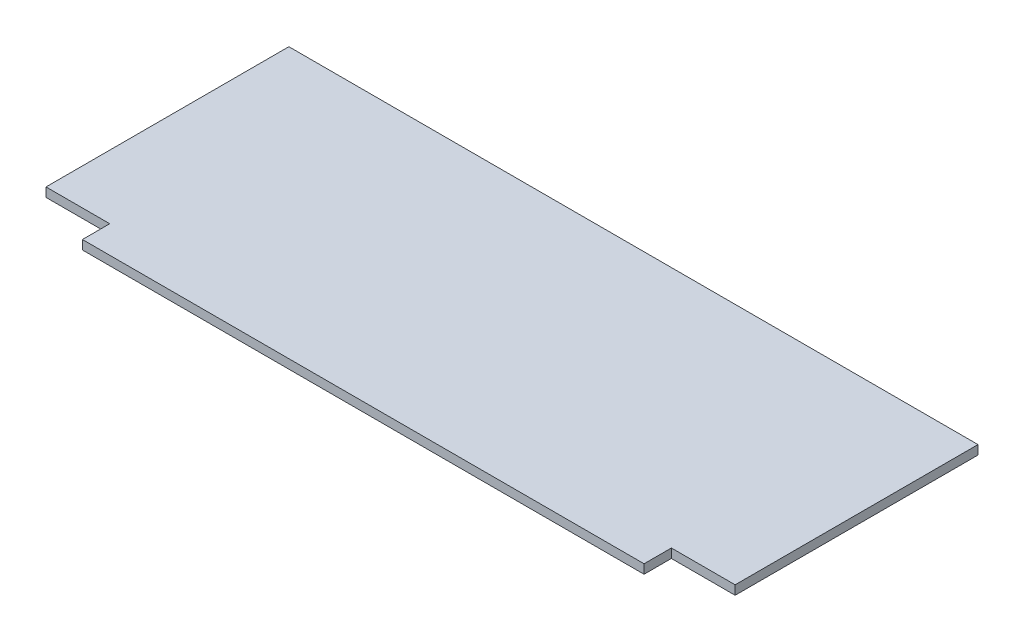
ISO-10303-21;
HEADER;
FILE_DESCRIPTION(('STEP AP214'),'2;1');
FILE_NAME('part.step','',(''),(''),'','','');
FILE_SCHEMA(('AUTOMOTIVE_DESIGN { 1 0 10303 214 1 1 1 1 }'));
ENDSEC;
DATA;
#1=APPLICATION_CONTEXT('core data for automotive mechanical design processes');
#2=APPLICATION_PROTOCOL_DEFINITION('international standard','automotive_design',2000,#1);
#3=PRODUCT_CONTEXT('',#1,'mechanical');
#4=PRODUCT('Part','Part','',(#3));
#5=PRODUCT_RELATED_PRODUCT_CATEGORY('part','',(#4));
#6=PRODUCT_DEFINITION_FORMATION('','',#4);
#7=PRODUCT_DEFINITION_CONTEXT('part definition',#1,'design');
#8=PRODUCT_DEFINITION('design','',#6,#7);
#9=PRODUCT_DEFINITION_SHAPE('','',#8);
#10=(LENGTH_UNIT() NAMED_UNIT(*) SI_UNIT(.MILLI.,.METRE.));
#11=(NAMED_UNIT(*) PLANE_ANGLE_UNIT() SI_UNIT($,.RADIAN.));
#12=(NAMED_UNIT(*) SI_UNIT($,.STERADIAN.) SOLID_ANGLE_UNIT());
#13=UNCERTAINTY_MEASURE_WITH_UNIT(LENGTH_MEASURE(1.E-05),#10,'distance_accuracy_value','');
#14=(GEOMETRIC_REPRESENTATION_CONTEXT(3) GLOBAL_UNCERTAINTY_ASSIGNED_CONTEXT((#13)) GLOBAL_UNIT_ASSIGNED_CONTEXT((#10,
#11,#12)) REPRESENTATION_CONTEXT('',''));
#15=CARTESIAN_POINT('',(0.,0.,0.));
#16=DIRECTION('',(0.,0.,1.));
#17=DIRECTION('',(1.,0.,0.));
#18=AXIS2_PLACEMENT_3D('',#15,#16,#17);
#19=CARTESIAN_POINT('',(0.,3.,44.5));
#20=DIRECTION('',(0.,0.,-1.));
#21=DIRECTION('',(-1.,0.,0.));
#22=AXIS2_PLACEMENT_3D('',#19,#20,#21);
#23=PLANE('',#22);
#24=DIRECTION('',(1.,0.,0.));
#25=VECTOR('',#24,1.);
#26=CARTESIAN_POINT('',(0.,0.,44.5));
#27=LINE('',#26,#25);
#28=CARTESIAN_POINT('',(-92.5,0.,44.5));
#29=VERTEX_POINT('',#28);
#30=CARTESIAN_POINT('',(92.5,0.,44.5));
#31=VERTEX_POINT('',#30);
#32=EDGE_CURVE('E148',#29,#31,#27,.T.);
#33=ORIENTED_EDGE('',*,*,#32,.T.);
#34=DIRECTION('',(0.,-1.,0.));
#35=VECTOR('',#34,1.);
#36=CARTESIAN_POINT('',(92.5,3.,44.5));
#37=LINE('',#36,#35);
#38=CARTESIAN_POINT('',(92.5,3.,44.5));
#39=VERTEX_POINT('',#38);
#40=EDGE_CURVE('E11',#39,#31,#37,.T.);
#41=ORIENTED_EDGE('',*,*,#40,.F.);
#42=DIRECTION('',(1.,0.,0.));
#43=VECTOR('',#42,1.);
#44=CARTESIAN_POINT('',(0.,3.,44.5));
#45=LINE('',#44,#43);
#46=CARTESIAN_POINT('',(-92.5,3.,44.5));
#47=VERTEX_POINT('',#46);
#48=EDGE_CURVE('E176',#47,#39,#45,.T.);
#49=ORIENTED_EDGE('',*,*,#48,.F.);
#50=DIRECTION('',(0.,-1.,0.));
#51=VECTOR('',#50,1.);
#52=CARTESIAN_POINT('',(-92.5,3.,44.5));
#53=LINE('',#52,#51);
#54=EDGE_CURVE('E61',#47,#29,#53,.T.);
#55=ORIENTED_EDGE('',*,*,#54,.T.);
#56=EDGE_LOOP('',(#33,#41,#49,#55));
#57=FACE_BOUND('',#56,.T.);
#58=ADVANCED_FACE('F44',(#57),#23,.F.);
#59=CARTESIAN_POINT('',(92.5,3.,0.));
#60=DIRECTION('',(-1.,0.,0.));
#61=DIRECTION('',(0.,0.,1.));
#62=AXIS2_PLACEMENT_3D('',#59,#60,#61);
#63=PLANE('',#62);
#64=DIRECTION('',(0.,0.,-1.));
#65=VECTOR('',#64,1.);
#66=CARTESIAN_POINT('',(92.5,0.,0.));
#67=LINE('',#66,#65);
#68=CARTESIAN_POINT('',(92.5,0.,35.5));
#69=VERTEX_POINT('',#68);
#70=EDGE_CURVE('E151',#31,#69,#67,.T.);
#71=ORIENTED_EDGE('',*,*,#70,.T.);
#72=DIRECTION('',(0.,-1.,0.));
#73=VECTOR('',#72,1.);
#74=CARTESIAN_POINT('',(92.5,3.,35.5));
#75=LINE('',#74,#73);
#76=CARTESIAN_POINT('',(92.5,3.,35.5));
#77=VERTEX_POINT('',#76);
#78=EDGE_CURVE('E53',#77,#69,#75,.T.);
#79=ORIENTED_EDGE('',*,*,#78,.F.);
#80=DIRECTION('',(0.,0.,-1.));
#81=VECTOR('',#80,1.);
#82=CARTESIAN_POINT('',(92.5,3.,0.));
#83=LINE('',#82,#81);
#84=EDGE_CURVE('E100',#39,#77,#83,.T.);
#85=ORIENTED_EDGE('',*,*,#84,.F.);
#86=ORIENTED_EDGE('',*,*,#40,.T.);
#87=EDGE_LOOP('',(#71,#79,#85,#86));
#88=FACE_BOUND('',#87,.T.);
#89=ADVANCED_FACE('F195',(#88),#63,.F.);
#90=CARTESIAN_POINT('',(0.,3.,35.5));
#91=DIRECTION('',(0.,0.,1.));
#92=DIRECTION('',(1.,0.,0.));
#93=AXIS2_PLACEMENT_3D('',#90,#91,#92);
#94=PLANE('',#93);
#95=DIRECTION('',(-1.,0.,0.));
#96=VECTOR('',#95,1.);
#97=CARTESIAN_POINT('',(0.,0.,35.5));
#98=LINE('',#97,#96);
#99=CARTESIAN_POINT('',(113.5,0.,35.5));
#100=VERTEX_POINT('',#99);
#101=EDGE_CURVE('E155',#100,#69,#98,.T.);
#102=ORIENTED_EDGE('',*,*,#101,.F.);
#103=DIRECTION('',(0.,-1.,0.));
#104=VECTOR('',#103,1.);
#105=CARTESIAN_POINT('',(113.5,3.,35.5));
#106=LINE('',#105,#104);
#107=CARTESIAN_POINT('',(113.5,3.,35.5));
#108=VERTEX_POINT('',#107);
#109=EDGE_CURVE('E186',#108,#100,#106,.T.);
#110=ORIENTED_EDGE('',*,*,#109,.F.);
#111=DIRECTION('',(-1.,0.,0.));
#112=VECTOR('',#111,1.);
#113=CARTESIAN_POINT('',(0.,3.,35.5));
#114=LINE('',#113,#112);
#115=EDGE_CURVE('E194',#108,#77,#114,.T.);
#116=ORIENTED_EDGE('',*,*,#115,.T.);
#117=ORIENTED_EDGE('',*,*,#78,.T.);
#118=EDGE_LOOP('',(#102,#110,#116,#117));
#119=FACE_BOUND('',#118,.T.);
#120=ADVANCED_FACE('F192',(#119),#94,.T.);
#121=CARTESIAN_POINT('',(113.5,3.,0.));
#122=DIRECTION('',(-1.,0.,0.));
#123=DIRECTION('',(0.,0.,1.));
#124=AXIS2_PLACEMENT_3D('',#121,#122,#123);
#125=PLANE('',#124);
#126=DIRECTION('',(0.,0.,-1.));
#127=VECTOR('',#126,1.);
#128=CARTESIAN_POINT('',(113.5,0.,0.));
#129=LINE('',#128,#127);
#130=CARTESIAN_POINT('',(113.5,0.,-44.5));
#131=VERTEX_POINT('',#130);
#132=EDGE_CURVE('E159',#100,#131,#129,.T.);
#133=ORIENTED_EDGE('',*,*,#132,.T.);
#134=DIRECTION('',(0.,-1.,0.));
#135=VECTOR('',#134,1.);
#136=CARTESIAN_POINT('',(113.5,3.,-44.5));
#137=LINE('',#136,#135);
#138=CARTESIAN_POINT('',(113.5,3.,-44.5));
#139=VERTEX_POINT('',#138);
#140=EDGE_CURVE('E183',#139,#131,#137,.T.);
#141=ORIENTED_EDGE('',*,*,#140,.F.);
#142=DIRECTION('',(0.,0.,-1.));
#143=VECTOR('',#142,1.);
#144=CARTESIAN_POINT('',(113.5,3.,0.));
#145=LINE('',#144,#143);
#146=EDGE_CURVE('E142',#108,#139,#145,.T.);
#147=ORIENTED_EDGE('',*,*,#146,.F.);
#148=ORIENTED_EDGE('',*,*,#109,.T.);
#149=EDGE_LOOP('',(#133,#141,#147,#148));
#150=FACE_BOUND('',#149,.T.);
#151=ADVANCED_FACE('F203',(#150),#125,.F.);
#152=CARTESIAN_POINT('',(0.,3.,-44.5));
#153=DIRECTION('',(0.,0.,-1.));
#154=DIRECTION('',(-1.,0.,0.));
#155=AXIS2_PLACEMENT_3D('',#152,#153,#154);
#156=PLANE('',#155);
#157=DIRECTION('',(1.,0.,0.));
#158=VECTOR('',#157,1.);
#159=CARTESIAN_POINT('',(0.,0.,-44.5));
#160=LINE('',#159,#158);
#161=CARTESIAN_POINT('',(-113.5,0.,-44.5));
#162=VERTEX_POINT('',#161);
#163=EDGE_CURVE('E163',#162,#131,#160,.T.);
#164=ORIENTED_EDGE('',*,*,#163,.F.);
#165=DIRECTION('',(0.,-1.,0.));
#166=VECTOR('',#165,1.);
#167=CARTESIAN_POINT('',(-113.5,3.,-44.5));
#168=LINE('',#167,#166);
#169=CARTESIAN_POINT('',(-113.5,3.,-44.5));
#170=VERTEX_POINT('',#169);
#171=EDGE_CURVE('E126',#170,#162,#168,.T.);
#172=ORIENTED_EDGE('',*,*,#171,.F.);
#173=DIRECTION('',(1.,0.,0.));
#174=VECTOR('',#173,1.);
#175=CARTESIAN_POINT('',(0.,3.,-44.5));
#176=LINE('',#175,#174);
#177=EDGE_CURVE('E138',#170,#139,#176,.T.);
#178=ORIENTED_EDGE('',*,*,#177,.T.);
#179=ORIENTED_EDGE('',*,*,#140,.T.);
#180=EDGE_LOOP('',(#164,#172,#178,#179));
#181=FACE_BOUND('',#180,.T.);
#182=ADVANCED_FACE('F233',(#181),#156,.T.);
#183=CARTESIAN_POINT('',(-113.5,3.,0.));
#184=DIRECTION('',(-1.,0.,0.));
#185=DIRECTION('',(0.,0.,1.));
#186=AXIS2_PLACEMENT_3D('',#183,#184,#185);
#187=PLANE('',#186);
#188=DIRECTION('',(0.,0.,-1.));
#189=VECTOR('',#188,1.);
#190=CARTESIAN_POINT('',(-113.5,0.,0.));
#191=LINE('',#190,#189);
#192=CARTESIAN_POINT('',(-113.5,0.,35.5));
#193=VERTEX_POINT('',#192);
#194=EDGE_CURVE('E122',#193,#162,#191,.T.);
#195=ORIENTED_EDGE('',*,*,#194,.F.);
#196=DIRECTION('',(0.,-1.,0.));
#197=VECTOR('',#196,1.);
#198=CARTESIAN_POINT('',(-113.5,3.,35.5));
#199=LINE('',#198,#197);
#200=CARTESIAN_POINT('',(-113.5,3.,35.5));
#201=VERTEX_POINT('',#200);
#202=EDGE_CURVE('E116',#201,#193,#199,.T.);
#203=ORIENTED_EDGE('',*,*,#202,.F.);
#204=DIRECTION('',(0.,0.,-1.));
#205=VECTOR('',#204,1.);
#206=CARTESIAN_POINT('',(-113.5,3.,0.));
#207=LINE('',#206,#205);
#208=EDGE_CURVE('E120',#201,#170,#207,.T.);
#209=ORIENTED_EDGE('',*,*,#208,.T.);
#210=ORIENTED_EDGE('',*,*,#171,.T.);
#211=EDGE_LOOP('',(#195,#203,#209,#210));
#212=FACE_BOUND('',#211,.T.);
#213=ADVANCED_FACE('F118',(#212),#187,.T.);
#214=CARTESIAN_POINT('',(0.,3.,35.5));
#215=DIRECTION('',(0.,0.,-1.));
#216=DIRECTION('',(-1.,0.,0.));
#217=AXIS2_PLACEMENT_3D('',#214,#215,#216);
#218=PLANE('',#217);
#219=DIRECTION('',(1.,0.,0.));
#220=VECTOR('',#219,1.);
#221=CARTESIAN_POINT('',(0.,0.,35.5));
#222=LINE('',#221,#220);
#223=CARTESIAN_POINT('',(-92.5,0.,35.5));
#224=VERTEX_POINT('',#223);
#225=EDGE_CURVE('E169',#193,#224,#222,.T.);
#226=ORIENTED_EDGE('',*,*,#225,.T.);
#227=DIRECTION('',(0.,-1.,0.));
#228=VECTOR('',#227,1.);
#229=CARTESIAN_POINT('',(-92.5,3.,35.5));
#230=LINE('',#229,#228);
#231=CARTESIAN_POINT('',(-92.5,3.,35.5));
#232=VERTEX_POINT('',#231);
#233=EDGE_CURVE('E88',#232,#224,#230,.T.);
#234=ORIENTED_EDGE('',*,*,#233,.F.);
#235=DIRECTION('',(1.,0.,0.));
#236=VECTOR('',#235,1.);
#237=CARTESIAN_POINT('',(0.,3.,35.5));
#238=LINE('',#237,#236);
#239=EDGE_CURVE('E128',#201,#232,#238,.T.);
#240=ORIENTED_EDGE('',*,*,#239,.F.);
#241=ORIENTED_EDGE('',*,*,#202,.T.);
#242=EDGE_LOOP('',(#226,#234,#240,#241));
#243=FACE_BOUND('',#242,.T.);
#244=ADVANCED_FACE('F129',(#243),#218,.F.);
#245=CARTESIAN_POINT('',(-92.5,3.,0.));
#246=DIRECTION('',(-1.,0.,0.));
#247=DIRECTION('',(0.,0.,1.));
#248=AXIS2_PLACEMENT_3D('',#245,#246,#247);
#249=PLANE('',#248);
#250=DIRECTION('',(0.,0.,-1.));
#251=VECTOR('',#250,1.);
#252=CARTESIAN_POINT('',(-92.5,0.,0.));
#253=LINE('',#252,#251);
#254=EDGE_CURVE('E172',#29,#224,#253,.T.);
#255=ORIENTED_EDGE('',*,*,#254,.F.);
#256=ORIENTED_EDGE('',*,*,#54,.F.);
#257=DIRECTION('',(0.,0.,-1.));
#258=VECTOR('',#257,1.);
#259=CARTESIAN_POINT('',(-92.5,3.,0.));
#260=LINE('',#259,#258);
#261=EDGE_CURVE('E133',#47,#232,#260,.T.);
#262=ORIENTED_EDGE('',*,*,#261,.T.);
#263=ORIENTED_EDGE('',*,*,#233,.T.);
#264=EDGE_LOOP('',(#255,#256,#262,#263));
#265=FACE_BOUND('',#264,.T.);
#266=ADVANCED_FACE('F212',(#265),#249,.T.);
#267=CARTESIAN_POINT('',(0.,3.,0.));
#268=DIRECTION('',(0.,1.,0.));
#269=DIRECTION('',(0.,0.,1.));
#270=AXIS2_PLACEMENT_3D('',#267,#268,#269);
#271=PLANE('',#270);
#272=ORIENTED_EDGE('',*,*,#48,.T.);
#273=ORIENTED_EDGE('',*,*,#84,.T.);
#274=ORIENTED_EDGE('',*,*,#115,.F.);
#275=ORIENTED_EDGE('',*,*,#146,.T.);
#276=ORIENTED_EDGE('',*,*,#177,.F.);
#277=ORIENTED_EDGE('',*,*,#208,.F.);
#278=ORIENTED_EDGE('',*,*,#239,.T.);
#279=ORIENTED_EDGE('',*,*,#261,.F.);
#280=EDGE_LOOP('',(#272,#273,#274,#275,#276,#277,#278,#279));
#281=FACE_BOUND('',#280,.T.);
#282=ADVANCED_FACE('F136',(#281),#271,.T.);
#283=CARTESIAN_POINT('',(0.,0.,0.));
#284=DIRECTION('',(0.,1.,0.));
#285=DIRECTION('',(0.,0.,1.));
#286=AXIS2_PLACEMENT_3D('',#283,#284,#285);
#287=PLANE('',#286);
#288=ORIENTED_EDGE('',*,*,#32,.F.);
#289=ORIENTED_EDGE('',*,*,#254,.T.);
#290=ORIENTED_EDGE('',*,*,#225,.F.);
#291=ORIENTED_EDGE('',*,*,#194,.T.);
#292=ORIENTED_EDGE('',*,*,#163,.T.);
#293=ORIENTED_EDGE('',*,*,#132,.F.);
#294=ORIENTED_EDGE('',*,*,#101,.T.);
#295=ORIENTED_EDGE('',*,*,#70,.F.);
#296=EDGE_LOOP('',(#288,#289,#290,#291,#292,#293,#294,#295));
#297=FACE_BOUND('',#296,.T.);
#298=ADVANCED_FACE('F199',(#297),#287,.F.);
#299=CLOSED_SHELL('',(#58,#89,#120,#151,#182,#213,#244,#266,#282,#298));
#300=MANIFOLD_SOLID_BREP('B2',#299);
#301=ADVANCED_BREP_SHAPE_REPRESENTATION('',(#18,#300),#14);
#302=SHAPE_DEFINITION_REPRESENTATION(#9,#301);
ENDSEC;
END-ISO-10303-21;
